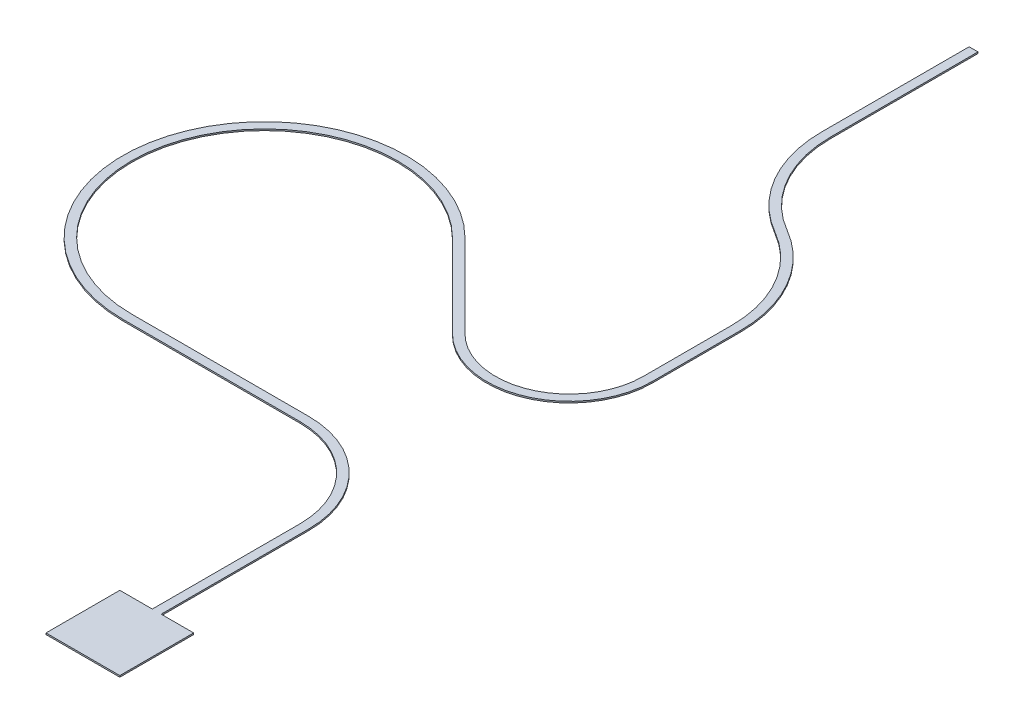
ISO-10303-21;
HEADER;
FILE_DESCRIPTION(('STEP AP214'),'2;1');
FILE_NAME('part.step','',(''),(''),'','','');
FILE_SCHEMA(('AUTOMOTIVE_DESIGN { 1 0 10303 214 1 1 1 1 }'));
ENDSEC;
DATA;
#1=APPLICATION_CONTEXT('core data for automotive mechanical design processes');
#2=APPLICATION_PROTOCOL_DEFINITION('international standard','automotive_design',2000,#1);
#3=PRODUCT_CONTEXT('',#1,'mechanical');
#4=PRODUCT('Part','Part','',(#3));
#5=PRODUCT_RELATED_PRODUCT_CATEGORY('part','',(#4));
#6=PRODUCT_DEFINITION_FORMATION('','',#4);
#7=PRODUCT_DEFINITION_CONTEXT('part definition',#1,'design');
#8=PRODUCT_DEFINITION('design','',#6,#7);
#9=PRODUCT_DEFINITION_SHAPE('','',#8);
#10=(LENGTH_UNIT() NAMED_UNIT(*) SI_UNIT(.MILLI.,.METRE.));
#11=(NAMED_UNIT(*) PLANE_ANGLE_UNIT() SI_UNIT($,.RADIAN.));
#12=(NAMED_UNIT(*) SI_UNIT($,.STERADIAN.) SOLID_ANGLE_UNIT());
#13=UNCERTAINTY_MEASURE_WITH_UNIT(LENGTH_MEASURE(1.E-05),#10,'distance_accuracy_value','');
#14=(GEOMETRIC_REPRESENTATION_CONTEXT(3) GLOBAL_UNCERTAINTY_ASSIGNED_CONTEXT((#13)) GLOBAL_UNIT_ASSIGNED_CONTEXT((#10,
#11,#12)) REPRESENTATION_CONTEXT('',''));
#15=CARTESIAN_POINT('',(0.,0.,0.));
#16=DIRECTION('',(0.,0.,1.));
#17=DIRECTION('',(1.,0.,0.));
#18=AXIS2_PLACEMENT_3D('',#15,#16,#17);
#19=CARTESIAN_POINT('',(125.,5.,-125.));
#20=DIRECTION('',(-1.,0.,0.));
#21=DIRECTION('',(0.,0.,1.));
#22=AXIS2_PLACEMENT_3D('',#19,#20,#21);
#23=PLANE('',#22);
#24=DIRECTION('',(0.,0.,-1.));
#25=VECTOR('',#24,1.);
#26=CARTESIAN_POINT('',(125.,0.,-125.));
#27=LINE('',#26,#25);
#28=CARTESIAN_POINT('',(125.,0.,125.));
#29=VERTEX_POINT('',#28);
#30=CARTESIAN_POINT('',(125.,0.,-125.));
#31=VERTEX_POINT('',#30);
#32=EDGE_CURVE('E248',#29,#31,#27,.T.);
#33=ORIENTED_EDGE('',*,*,#32,.T.);
#34=DIRECTION('',(0.,-1.,0.));
#35=VECTOR('',#34,1.);
#36=CARTESIAN_POINT('',(125.,5.,-125.));
#37=LINE('',#36,#35);
#38=CARTESIAN_POINT('',(125.,5.,-125.));
#39=VERTEX_POINT('',#38);
#40=EDGE_CURVE('E11',#39,#31,#37,.T.);
#41=ORIENTED_EDGE('',*,*,#40,.F.);
#42=DIRECTION('',(0.,0.,-1.));
#43=VECTOR('',#42,1.);
#44=CARTESIAN_POINT('',(125.,5.,-125.));
#45=LINE('',#44,#43);
#46=CARTESIAN_POINT('',(125.,5.,125.));
#47=VERTEX_POINT('',#46);
#48=EDGE_CURVE('E324',#47,#39,#45,.T.);
#49=ORIENTED_EDGE('',*,*,#48,.F.);
#50=DIRECTION('',(0.,-1.,0.));
#51=VECTOR('',#50,1.);
#52=CARTESIAN_POINT('',(125.,5.,125.));
#53=LINE('',#52,#51);
#54=EDGE_CURVE('E244',#47,#29,#53,.T.);
#55=ORIENTED_EDGE('',*,*,#54,.T.);
#56=EDGE_LOOP('',(#33,#41,#49,#55));
#57=FACE_BOUND('',#56,.T.);
#58=ADVANCED_FACE('F39',(#57),#23,.F.);
#59=CARTESIAN_POINT('',(15.,5.,-125.));
#60=DIRECTION('',(0.,0.,1.));
#61=DIRECTION('',(1.,0.,0.));
#62=AXIS2_PLACEMENT_3D('',#59,#60,#61);
#63=PLANE('',#62);
#64=DIRECTION('',(-1.,0.,0.));
#65=VECTOR('',#64,1.);
#66=CARTESIAN_POINT('',(15.,0.,-125.));
#67=LINE('',#66,#65);
#68=CARTESIAN_POINT('',(15.,0.,-125.));
#69=VERTEX_POINT('',#68);
#70=EDGE_CURVE('E252',#31,#69,#67,.T.);
#71=ORIENTED_EDGE('',*,*,#70,.T.);
#72=DIRECTION('',(0.,-1.,0.));
#73=VECTOR('',#72,1.);
#74=CARTESIAN_POINT('',(15.,5.,-125.));
#75=LINE('',#74,#73);
#76=CARTESIAN_POINT('',(15.,5.,-125.));
#77=VERTEX_POINT('',#76);
#78=EDGE_CURVE('E48',#77,#69,#75,.T.);
#79=ORIENTED_EDGE('',*,*,#78,.F.);
#80=DIRECTION('',(-1.,0.,0.));
#81=VECTOR('',#80,1.);
#82=CARTESIAN_POINT('',(15.,5.,-125.));
#83=LINE('',#82,#81);
#84=EDGE_CURVE('E153',#39,#77,#83,.T.);
#85=ORIENTED_EDGE('',*,*,#84,.F.);
#86=ORIENTED_EDGE('',*,*,#40,.T.);
#87=EDGE_LOOP('',(#71,#79,#85,#86));
#88=FACE_BOUND('',#87,.T.);
#89=ADVANCED_FACE('F516',(#88),#63,.F.);
#90=CARTESIAN_POINT('',(15.,5.,-125.));
#91=DIRECTION('',(-1.,0.,0.));
#92=DIRECTION('',(0.,0.,1.));
#93=AXIS2_PLACEMENT_3D('',#90,#91,#92);
#94=PLANE('',#93);
#95=DIRECTION('',(0.,0.,-1.));
#96=VECTOR('',#95,1.);
#97=CARTESIAN_POINT('',(15.,0.,-125.));
#98=LINE('',#97,#96);
#99=CARTESIAN_POINT('',(14.9999999999999,0.,-625.));
#100=VERTEX_POINT('',#99);
#101=EDGE_CURVE('E255',#69,#100,#98,.T.);
#102=ORIENTED_EDGE('',*,*,#101,.T.);
#103=DIRECTION('',(0.,-1.,0.));
#104=VECTOR('',#103,1.);
#105=CARTESIAN_POINT('',(14.9999999999999,5.,-625.));
#106=LINE('',#105,#104);
#107=CARTESIAN_POINT('',(14.9999999999999,5.,-625.));
#108=VERTEX_POINT('',#107);
#109=EDGE_CURVE('E407',#108,#100,#106,.T.);
#110=ORIENTED_EDGE('',*,*,#109,.F.);
#111=DIRECTION('',(0.,0.,-1.));
#112=VECTOR('',#111,1.);
#113=CARTESIAN_POINT('',(15.,5.,-125.));
#114=LINE('',#113,#112);
#115=EDGE_CURVE('E417',#77,#108,#114,.T.);
#116=ORIENTED_EDGE('',*,*,#115,.F.);
#117=ORIENTED_EDGE('',*,*,#78,.T.);
#118=EDGE_LOOP('',(#102,#110,#116,#117));
#119=FACE_BOUND('',#118,.T.);
#120=ADVANCED_FACE('F415',(#119),#94,.F.);
#121=CARTESIAN_POINT('',(-315.,5.,-625.));
#122=DIRECTION('',(0.,-1.,0.));
#123=DIRECTION('',(0.,0.,-1.));
#124=AXIS2_PLACEMENT_3D('',#121,#122,#123);
#125=CYLINDRICAL_SURFACE('',#124,330.);
#126=CARTESIAN_POINT('',(-315.,0.,-625.));
#127=DIRECTION('',(0.,1.,0.));
#128=DIRECTION('',(0.,0.,1.));
#129=AXIS2_PLACEMENT_3D('',#126,#127,#128);
#130=CIRCLE('',#129,330.);
#131=CARTESIAN_POINT('',(-315.,0.,-955.));
#132=VERTEX_POINT('',#131);
#133=EDGE_CURVE('E258',#100,#132,#130,.T.);
#134=ORIENTED_EDGE('',*,*,#133,.T.);
#135=DIRECTION('',(0.,-1.,0.));
#136=VECTOR('',#135,1.);
#137=CARTESIAN_POINT('',(-315.,5.,-955.));
#138=LINE('',#137,#136);
#139=CARTESIAN_POINT('',(-315.,5.,-955.));
#140=VERTEX_POINT('',#139);
#141=EDGE_CURVE('E403',#140,#132,#138,.T.);
#142=ORIENTED_EDGE('',*,*,#141,.F.);
#143=CARTESIAN_POINT('',(-315.,5.,-625.));
#144=DIRECTION('',(0.,1.,0.));
#145=DIRECTION('',(0.,0.,1.));
#146=AXIS2_PLACEMENT_3D('',#143,#144,#145);
#147=CIRCLE('',#146,330.);
#148=EDGE_CURVE('E436',#108,#140,#147,.T.);
#149=ORIENTED_EDGE('',*,*,#148,.F.);
#150=ORIENTED_EDGE('',*,*,#109,.T.);
#151=EDGE_LOOP('',(#134,#142,#149,#150));
#152=FACE_BOUND('',#151,.T.);
#153=ADVANCED_FACE('F426',(#152),#125,.T.);
#154=CARTESIAN_POINT('',(-315.,5.,-955.));
#155=DIRECTION('',(0.,0.,1.));
#156=DIRECTION('',(1.,0.,0.));
#157=AXIS2_PLACEMENT_3D('',#154,#155,#156);
#158=PLANE('',#157);
#159=DIRECTION('',(-1.,0.,0.));
#160=VECTOR('',#159,1.);
#161=CARTESIAN_POINT('',(-315.,0.,-955.));
#162=LINE('',#161,#160);
#163=CARTESIAN_POINT('',(-915.,0.,-955.));
#164=VERTEX_POINT('',#163);
#165=EDGE_CURVE('E261',#132,#164,#162,.T.);
#166=ORIENTED_EDGE('',*,*,#165,.T.);
#167=DIRECTION('',(0.,-1.,0.));
#168=VECTOR('',#167,1.);
#169=CARTESIAN_POINT('',(-915.,5.,-955.));
#170=LINE('',#169,#168);
#171=CARTESIAN_POINT('',(-915.,5.,-955.));
#172=VERTEX_POINT('',#171);
#173=EDGE_CURVE('E399',#172,#164,#170,.T.);
#174=ORIENTED_EDGE('',*,*,#173,.F.);
#175=DIRECTION('',(-1.,0.,0.));
#176=VECTOR('',#175,1.);
#177=CARTESIAN_POINT('',(-315.,5.,-955.));
#178=LINE('',#177,#176);
#179=EDGE_CURVE('E432',#140,#172,#178,.T.);
#180=ORIENTED_EDGE('',*,*,#179,.F.);
#181=ORIENTED_EDGE('',*,*,#141,.T.);
#182=EDGE_LOOP('',(#166,#174,#180,#181));
#183=FACE_BOUND('',#182,.T.);
#184=ADVANCED_FACE('F430',(#183),#158,.F.);
#185=CARTESIAN_POINT('',(-915.,5.,-1405.));
#186=DIRECTION('',(0.,-1.,0.));
#187=DIRECTION('',(0.,0.,-1.));
#188=AXIS2_PLACEMENT_3D('',#185,#186,#187);
#189=CYLINDRICAL_SURFACE('',#188,450.);
#190=CARTESIAN_POINT('',(-915.,0.,-1405.));
#191=DIRECTION('',(0.,-1.,0.));
#192=DIRECTION('',(0.,0.,-1.));
#193=AXIS2_PLACEMENT_3D('',#190,#191,#192);
#194=CIRCLE('',#193,450.);
#195=CARTESIAN_POINT('',(-596.801948466055,0.,-1723.19805153395));
#196=VERTEX_POINT('',#195);
#197=EDGE_CURVE('E264',#164,#196,#194,.T.);
#198=ORIENTED_EDGE('',*,*,#197,.T.);
#199=DIRECTION('',(0.,-1.,0.));
#200=VECTOR('',#199,1.);
#201=CARTESIAN_POINT('',(-596.801948466055,5.,-1723.19805153395));
#202=LINE('',#201,#200);
#203=CARTESIAN_POINT('',(-596.801948466055,5.,-1723.19805153395));
#204=VERTEX_POINT('',#203);
#205=EDGE_CURVE('E395',#204,#196,#202,.T.);
#206=ORIENTED_EDGE('',*,*,#205,.F.);
#207=CARTESIAN_POINT('',(-915.,5.,-1405.));
#208=DIRECTION('',(0.,-1.,0.));
#209=DIRECTION('',(0.,0.,-1.));
#210=AXIS2_PLACEMENT_3D('',#207,#208,#209);
#211=CIRCLE('',#210,450.);
#212=EDGE_CURVE('E435',#172,#204,#211,.T.);
#213=ORIENTED_EDGE('',*,*,#212,.F.);
#214=ORIENTED_EDGE('',*,*,#173,.T.);
#215=EDGE_LOOP('',(#198,#206,#213,#214));
#216=FACE_BOUND('',#215,.T.);
#217=ADVANCED_FACE('F529',(#216),#189,.F.);
#218=CARTESIAN_POINT('',(-596.801948466055,5.,-1723.19805153395));
#219=DIRECTION('',(0.707106781186542,0.,-0.707106781186553));
#220=DIRECTION('',(-0.707106781186553,0.,-0.707106781186542));
#221=AXIS2_PLACEMENT_3D('',#218,#219,#220);
#222=PLANE('',#221);
#223=DIRECTION('',(0.707106781186553,0.,0.707106781186543));
#224=VECTOR('',#223,1.);
#225=CARTESIAN_POINT('',(-596.801948466055,0.,-1723.19805153395));
#226=LINE('',#225,#224);
#227=CARTESIAN_POINT('',(-313.959235991436,0.,-1440.35533905933));
#228=VERTEX_POINT('',#227);
#229=EDGE_CURVE('E267',#196,#228,#226,.T.);
#230=ORIENTED_EDGE('',*,*,#229,.T.);
#231=DIRECTION('',(0.,-1.,0.));
#232=VECTOR('',#231,1.);
#233=CARTESIAN_POINT('',(-313.959235991436,5.,-1440.35533905933));
#234=LINE('',#233,#232);
#235=CARTESIAN_POINT('',(-313.959235991436,5.,-1440.35533905933));
#236=VERTEX_POINT('',#235);
#237=EDGE_CURVE('E391',#236,#228,#234,.T.);
#238=ORIENTED_EDGE('',*,*,#237,.F.);
#239=DIRECTION('',(0.707106781186553,0.,0.707106781186543));
#240=VECTOR('',#239,1.);
#241=CARTESIAN_POINT('',(-596.801948466055,5.,-1723.19805153395));
#242=LINE('',#241,#240);
#243=EDGE_CURVE('E440',#204,#236,#242,.T.);
#244=ORIENTED_EDGE('',*,*,#243,.F.);
#245=ORIENTED_EDGE('',*,*,#205,.T.);
#246=EDGE_LOOP('',(#230,#238,#244,#245));
#247=FACE_BOUND('',#246,.T.);
#248=ADVANCED_FACE('F532',(#247),#222,.F.);
#249=CARTESIAN_POINT('',(-115.969337259203,5.,-1638.34523779157));
#250=DIRECTION('',(0.,-1.,0.));
#251=DIRECTION('',(0.,0.,-1.));
#252=AXIS2_PLACEMENT_3D('',#249,#250,#251);
#253=CYLINDRICAL_SURFACE('',#252,280.);
#254=CARTESIAN_POINT('',(-115.969337259203,0.,-1638.34523779157));
#255=DIRECTION('',(0.,1.,0.));
#256=DIRECTION('',(0.,0.,1.));
#257=AXIS2_PLACEMENT_3D('',#254,#255,#256);
#258=CIRCLE('',#257,280.);
#259=CARTESIAN_POINT('',(164.030662740797,0.,-1638.34523779157));
#260=VERTEX_POINT('',#259);
#261=EDGE_CURVE('E270',#228,#260,#258,.T.);
#262=ORIENTED_EDGE('',*,*,#261,.T.);
#263=DIRECTION('',(0.,-1.,0.));
#264=VECTOR('',#263,1.);
#265=CARTESIAN_POINT('',(164.030662740797,5.,-1638.34523779157));
#266=LINE('',#265,#264);
#267=CARTESIAN_POINT('',(164.030662740797,5.,-1638.34523779157));
#268=VERTEX_POINT('',#267);
#269=EDGE_CURVE('E387',#268,#260,#266,.T.);
#270=ORIENTED_EDGE('',*,*,#269,.F.);
#271=CARTESIAN_POINT('',(-115.969337259203,5.,-1638.34523779157));
#272=DIRECTION('',(0.,1.,0.));
#273=DIRECTION('',(0.,0.,1.));
#274=AXIS2_PLACEMENT_3D('',#271,#272,#273);
#275=CIRCLE('',#274,280.);
#276=EDGE_CURVE('E447',#236,#268,#275,.T.);
#277=ORIENTED_EDGE('',*,*,#276,.F.);
#278=ORIENTED_EDGE('',*,*,#237,.T.);
#279=EDGE_LOOP('',(#262,#270,#277,#278));
#280=FACE_BOUND('',#279,.T.);
#281=ADVANCED_FACE('F536',(#280),#253,.T.);
#282=CARTESIAN_POINT('',(164.030662740797,5.,-1638.34523779157));
#283=DIRECTION('',(-1.,0.,0.));
#284=DIRECTION('',(0.,0.,1.));
#285=AXIS2_PLACEMENT_3D('',#282,#283,#284);
#286=PLANE('',#285);
#287=DIRECTION('',(0.,0.,-1.));
#288=VECTOR('',#287,1.);
#289=CARTESIAN_POINT('',(164.030662740797,0.,-1638.34523779157));
#290=LINE('',#289,#288);
#291=CARTESIAN_POINT('',(164.030662740797,0.,-1938.34523779157));
#292=VERTEX_POINT('',#291);
#293=EDGE_CURVE('E273',#260,#292,#290,.T.);
#294=ORIENTED_EDGE('',*,*,#293,.T.);
#295=DIRECTION('',(0.,-1.,0.));
#296=VECTOR('',#295,1.);
#297=CARTESIAN_POINT('',(164.030662740797,5.,-1938.34523779157));
#298=LINE('',#297,#296);
#299=CARTESIAN_POINT('',(164.030662740797,5.,-1938.34523779157));
#300=VERTEX_POINT('',#299);
#301=EDGE_CURVE('E383',#300,#292,#298,.T.);
#302=ORIENTED_EDGE('',*,*,#301,.F.);
#303=DIRECTION('',(0.,0.,-1.));
#304=VECTOR('',#303,1.);
#305=CARTESIAN_POINT('',(164.030662740797,5.,-1638.34523779157));
#306=LINE('',#305,#304);
#307=EDGE_CURVE('E450',#268,#300,#306,.T.);
#308=ORIENTED_EDGE('',*,*,#307,.F.);
#309=ORIENTED_EDGE('',*,*,#269,.T.);
#310=EDGE_LOOP('',(#294,#302,#308,#309));
#311=FACE_BOUND('',#310,.T.);
#312=ADVANCED_FACE('F540',(#311),#286,.F.);
#313=CARTESIAN_POINT('',(-265.969337259203,5.,-1938.34523779157));
#314=DIRECTION('',(0.,-1.,0.));
#315=DIRECTION('',(0.,0.,-1.));
#316=AXIS2_PLACEMENT_3D('',#313,#314,#315);
#317=CYLINDRICAL_SURFACE('',#316,430.);
#318=CARTESIAN_POINT('',(-265.969337259203,0.,-1938.34523779157));
#319=DIRECTION('',(0.,1.,0.));
#320=DIRECTION('',(0.,0.,1.));
#321=AXIS2_PLACEMENT_3D('',#318,#319,#320);
#322=CIRCLE('',#321,430.);
#323=CARTESIAN_POINT('',(-50.9693372592044,0.,-2310.73616141887));
#324=VERTEX_POINT('',#323);
#325=EDGE_CURVE('E276',#292,#324,#322,.T.);
#326=ORIENTED_EDGE('',*,*,#325,.T.);
#327=DIRECTION('',(0.,-1.,0.));
#328=VECTOR('',#327,1.);
#329=CARTESIAN_POINT('',(-50.9693372592044,5.,-2310.73616141887));
#330=LINE('',#329,#328);
#331=CARTESIAN_POINT('',(-50.9693372592044,5.,-2310.73616141887));
#332=VERTEX_POINT('',#331);
#333=EDGE_CURVE('E379',#332,#324,#330,.T.);
#334=ORIENTED_EDGE('',*,*,#333,.F.);
#335=CARTESIAN_POINT('',(-265.969337259203,5.,-1938.34523779157));
#336=DIRECTION('',(0.,1.,0.));
#337=DIRECTION('',(0.,0.,1.));
#338=AXIS2_PLACEMENT_3D('',#335,#336,#337);
#339=CIRCLE('',#338,430.);
#340=EDGE_CURVE('E453',#300,#332,#339,.T.);
#341=ORIENTED_EDGE('',*,*,#340,.F.);
#342=ORIENTED_EDGE('',*,*,#301,.T.);
#343=EDGE_LOOP('',(#326,#334,#341,#342));
#344=FACE_BOUND('',#343,.T.);
#345=ADVANCED_FACE('F544',(#344),#317,.T.);
#346=CARTESIAN_POINT('',(149.030662740796,5.,-2657.14632293265));
#347=DIRECTION('',(0.,-1.,0.));
#348=DIRECTION('',(0.,0.,-1.));
#349=AXIS2_PLACEMENT_3D('',#346,#347,#348);
#350=CYLINDRICAL_SURFACE('',#349,400.000000000001);
#351=CARTESIAN_POINT('',(149.030662740796,0.,-2657.14632293265));
#352=DIRECTION('',(0.,-1.,0.));
#353=DIRECTION('',(0.,0.,-1.));
#354=AXIS2_PLACEMENT_3D('',#351,#352,#353);
#355=CIRCLE('',#354,400.000000000001);
#356=CARTESIAN_POINT('',(-250.969337259206,0.,-2657.14632293265));
#357=VERTEX_POINT('',#356);
#358=EDGE_CURVE('E279',#324,#357,#355,.T.);
#359=ORIENTED_EDGE('',*,*,#358,.T.);
#360=DIRECTION('',(0.,-1.,0.));
#361=VECTOR('',#360,1.);
#362=CARTESIAN_POINT('',(-250.969337259206,5.,-2657.14632293265));
#363=LINE('',#362,#361);
#364=CARTESIAN_POINT('',(-250.969337259206,5.,-2657.14632293265));
#365=VERTEX_POINT('',#364);
#366=EDGE_CURVE('E375',#365,#357,#363,.T.);
#367=ORIENTED_EDGE('',*,*,#366,.F.);
#368=CARTESIAN_POINT('',(149.030662740796,5.,-2657.14632293265));
#369=DIRECTION('',(0.,-1.,0.));
#370=DIRECTION('',(0.,0.,-1.));
#371=AXIS2_PLACEMENT_3D('',#368,#369,#370);
#372=CIRCLE('',#371,400.000000000001);
#373=EDGE_CURVE('E456',#332,#365,#372,.T.);
#374=ORIENTED_EDGE('',*,*,#373,.F.);
#375=ORIENTED_EDGE('',*,*,#333,.T.);
#376=EDGE_LOOP('',(#359,#367,#374,#375));
#377=FACE_BOUND('',#376,.T.);
#378=ADVANCED_FACE('F548',(#377),#350,.F.);
#379=CARTESIAN_POINT('',(-250.969337259206,5.,-2657.14632293265));
#380=DIRECTION('',(-1.,0.,0.));
#381=DIRECTION('',(0.,0.,1.));
#382=AXIS2_PLACEMENT_3D('',#379,#380,#381);
#383=PLANE('',#382);
#384=DIRECTION('',(0.,0.,-1.));
#385=VECTOR('',#384,1.);
#386=CARTESIAN_POINT('',(-250.969337259206,0.,-2657.14632293265));
#387=LINE('',#386,#385);
#388=CARTESIAN_POINT('',(-250.969337259206,0.,-3157.14632293265));
#389=VERTEX_POINT('',#388);
#390=EDGE_CURVE('E282',#357,#389,#387,.T.);
#391=ORIENTED_EDGE('',*,*,#390,.T.);
#392=DIRECTION('',(0.,-1.,0.));
#393=VECTOR('',#392,1.);
#394=CARTESIAN_POINT('',(-250.969337259206,5.,-3157.14632293265));
#395=LINE('',#394,#393);
#396=CARTESIAN_POINT('',(-250.969337259206,5.,-3157.14632293265));
#397=VERTEX_POINT('',#396);
#398=EDGE_CURVE('E371',#397,#389,#395,.T.);
#399=ORIENTED_EDGE('',*,*,#398,.F.);
#400=DIRECTION('',(0.,0.,-1.));
#401=VECTOR('',#400,1.);
#402=CARTESIAN_POINT('',(-250.969337259206,5.,-2657.14632293265));
#403=LINE('',#402,#401);
#404=EDGE_CURVE('E459',#365,#397,#403,.T.);
#405=ORIENTED_EDGE('',*,*,#404,.F.);
#406=ORIENTED_EDGE('',*,*,#366,.T.);
#407=EDGE_LOOP('',(#391,#399,#405,#406));
#408=FACE_BOUND('',#407,.T.);
#409=ADVANCED_FACE('F552',(#408),#383,.F.);
#410=CARTESIAN_POINT('',(-280.969337259205,5.,-3157.14632293265));
#411=DIRECTION('',(0.,0.,1.));
#412=DIRECTION('',(1.,0.,0.));
#413=AXIS2_PLACEMENT_3D('',#410,#411,#412);
#414=PLANE('',#413);
#415=DIRECTION('',(-1.,0.,0.));
#416=VECTOR('',#415,1.);
#417=CARTESIAN_POINT('',(-280.969337259205,0.,-3157.14632293265));
#418=LINE('',#417,#416);
#419=CARTESIAN_POINT('',(-280.969337259205,0.,-3157.14632293265));
#420=VERTEX_POINT('',#419);
#421=EDGE_CURVE('E285',#389,#420,#418,.T.);
#422=ORIENTED_EDGE('',*,*,#421,.T.);
#423=DIRECTION('',(0.,-1.,0.));
#424=VECTOR('',#423,1.);
#425=CARTESIAN_POINT('',(-280.969337259205,5.,-3157.14632293265));
#426=LINE('',#425,#424);
#427=CARTESIAN_POINT('',(-280.969337259205,5.,-3157.14632293265));
#428=VERTEX_POINT('',#427);
#429=EDGE_CURVE('E367',#428,#420,#426,.T.);
#430=ORIENTED_EDGE('',*,*,#429,.F.);
#431=DIRECTION('',(-1.,0.,0.));
#432=VECTOR('',#431,1.);
#433=CARTESIAN_POINT('',(-280.969337259205,5.,-3157.14632293265));
#434=LINE('',#433,#432);
#435=EDGE_CURVE('E462',#397,#428,#434,.T.);
#436=ORIENTED_EDGE('',*,*,#435,.F.);
#437=ORIENTED_EDGE('',*,*,#398,.T.);
#438=EDGE_LOOP('',(#422,#430,#436,#437));
#439=FACE_BOUND('',#438,.T.);
#440=ADVANCED_FACE('F556',(#439),#414,.F.);
#441=CARTESIAN_POINT('',(-280.969337259205,5.,-2657.14632293265));
#442=DIRECTION('',(1.,0.,0.));
#443=DIRECTION('',(0.,0.,-1.));
#444=AXIS2_PLACEMENT_3D('',#441,#442,#443);
#445=PLANE('',#444);
#446=DIRECTION('',(0.,0.,1.));
#447=VECTOR('',#446,1.);
#448=CARTESIAN_POINT('',(-280.969337259205,0.,-2657.14632293265));
#449=LINE('',#448,#447);
#450=CARTESIAN_POINT('',(-280.969337259204,0.,-2657.14632293265));
#451=VERTEX_POINT('',#450);
#452=EDGE_CURVE('E288',#420,#451,#449,.T.);
#453=ORIENTED_EDGE('',*,*,#452,.T.);
#454=DIRECTION('',(0.,-1.,0.));
#455=VECTOR('',#454,1.);
#456=CARTESIAN_POINT('',(-280.969337259204,5.,-2657.14632293265));
#457=LINE('',#456,#455);
#458=CARTESIAN_POINT('',(-280.969337259204,5.,-2657.14632293265));
#459=VERTEX_POINT('',#458);
#460=EDGE_CURVE('E363',#459,#451,#457,.T.);
#461=ORIENTED_EDGE('',*,*,#460,.F.);
#462=DIRECTION('',(0.,0.,1.));
#463=VECTOR('',#462,1.);
#464=CARTESIAN_POINT('',(-280.969337259205,5.,-2657.14632293265));
#465=LINE('',#464,#463);
#466=EDGE_CURVE('E465',#428,#459,#465,.T.);
#467=ORIENTED_EDGE('',*,*,#466,.F.);
#468=ORIENTED_EDGE('',*,*,#429,.T.);
#469=EDGE_LOOP('',(#453,#461,#467,#468));
#470=FACE_BOUND('',#469,.T.);
#471=ADVANCED_FACE('F560',(#470),#445,.F.);
#472=CARTESIAN_POINT('',(149.030662740796,5.,-2657.14632293265));
#473=DIRECTION('',(0.,-1.,0.));
#474=DIRECTION('',(0.,0.,-1.));
#475=AXIS2_PLACEMENT_3D('',#472,#473,#474);
#476=CYLINDRICAL_SURFACE('',#475,430.);
#477=CARTESIAN_POINT('',(149.030662740796,0.,-2657.14632293265));
#478=DIRECTION('',(0.,1.,0.));
#479=DIRECTION('',(0.,0.,-1.));
#480=AXIS2_PLACEMENT_3D('',#477,#478,#479);
#481=CIRCLE('',#480,430.);
#482=CARTESIAN_POINT('',(-65.9693372592044,0.,-2284.75539930534));
#483=VERTEX_POINT('',#482);
#484=EDGE_CURVE('E291',#451,#483,#481,.T.);
#485=ORIENTED_EDGE('',*,*,#484,.T.);
#486=DIRECTION('',(0.,-1.,0.));
#487=VECTOR('',#486,1.);
#488=CARTESIAN_POINT('',(-65.9693372592044,5.,-2284.75539930534));
#489=LINE('',#488,#487);
#490=CARTESIAN_POINT('',(-65.9693372592044,5.,-2284.75539930534));
#491=VERTEX_POINT('',#490);
#492=EDGE_CURVE('E359',#491,#483,#489,.T.);
#493=ORIENTED_EDGE('',*,*,#492,.F.);
#494=CARTESIAN_POINT('',(149.030662740796,5.,-2657.14632293265));
#495=DIRECTION('',(0.,1.,0.));
#496=DIRECTION('',(0.,0.,-1.));
#497=AXIS2_PLACEMENT_3D('',#494,#495,#496);
#498=CIRCLE('',#497,430.);
#499=EDGE_CURVE('E468',#459,#491,#498,.T.);
#500=ORIENTED_EDGE('',*,*,#499,.F.);
#501=ORIENTED_EDGE('',*,*,#460,.T.);
#502=EDGE_LOOP('',(#485,#493,#500,#501));
#503=FACE_BOUND('',#502,.T.);
#504=ADVANCED_FACE('F564',(#503),#476,.T.);
#505=CARTESIAN_POINT('',(-265.969337259203,5.,-1938.34523779157));
#506=DIRECTION('',(0.,-1.,0.));
#507=DIRECTION('',(0.,0.,-1.));
#508=AXIS2_PLACEMENT_3D('',#505,#506,#507);
#509=CYLINDRICAL_SURFACE('',#508,400.);
#510=CARTESIAN_POINT('',(-265.969337259203,0.,-1938.34523779157));
#511=DIRECTION('',(0.,-1.,0.));
#512=DIRECTION('',(0.,0.,1.));
#513=AXIS2_PLACEMENT_3D('',#510,#511,#512);
#514=CIRCLE('',#513,400.);
#515=CARTESIAN_POINT('',(134.030662740797,0.,-1938.34523779157));
#516=VERTEX_POINT('',#515);
#517=EDGE_CURVE('E294',#483,#516,#514,.T.);
#518=ORIENTED_EDGE('',*,*,#517,.T.);
#519=DIRECTION('',(0.,-1.,0.));
#520=VECTOR('',#519,1.);
#521=CARTESIAN_POINT('',(134.030662740797,5.,-1938.34523779157));
#522=LINE('',#521,#520);
#523=CARTESIAN_POINT('',(134.030662740797,5.,-1938.34523779157));
#524=VERTEX_POINT('',#523);
#525=EDGE_CURVE('E355',#524,#516,#522,.T.);
#526=ORIENTED_EDGE('',*,*,#525,.F.);
#527=CARTESIAN_POINT('',(-265.969337259203,5.,-1938.34523779157));
#528=DIRECTION('',(0.,-1.,0.));
#529=DIRECTION('',(0.,0.,1.));
#530=AXIS2_PLACEMENT_3D('',#527,#528,#529);
#531=CIRCLE('',#530,400.);
#532=EDGE_CURVE('E471',#491,#524,#531,.T.);
#533=ORIENTED_EDGE('',*,*,#532,.F.);
#534=ORIENTED_EDGE('',*,*,#492,.T.);
#535=EDGE_LOOP('',(#518,#526,#533,#534));
#536=FACE_BOUND('',#535,.T.);
#537=ADVANCED_FACE('F568',(#536),#509,.F.);
#538=CARTESIAN_POINT('',(134.030662740797,5.,-1638.34523779157));
#539=DIRECTION('',(1.,0.,0.));
#540=DIRECTION('',(0.,0.,-1.));
#541=AXIS2_PLACEMENT_3D('',#538,#539,#540);
#542=PLANE('',#541);
#543=DIRECTION('',(0.,0.,1.));
#544=VECTOR('',#543,1.);
#545=CARTESIAN_POINT('',(134.030662740797,0.,-1638.34523779157));
#546=LINE('',#545,#544);
#547=CARTESIAN_POINT('',(134.030662740797,0.,-1638.34523779157));
#548=VERTEX_POINT('',#547);
#549=EDGE_CURVE('E297',#516,#548,#546,.T.);
#550=ORIENTED_EDGE('',*,*,#549,.T.);
#551=DIRECTION('',(0.,-1.,0.));
#552=VECTOR('',#551,1.);
#553=CARTESIAN_POINT('',(134.030662740797,5.,-1638.34523779157));
#554=LINE('',#553,#552);
#555=CARTESIAN_POINT('',(134.030662740797,5.,-1638.34523779157));
#556=VERTEX_POINT('',#555);
#557=EDGE_CURVE('E351',#556,#548,#554,.T.);
#558=ORIENTED_EDGE('',*,*,#557,.F.);
#559=DIRECTION('',(0.,0.,1.));
#560=VECTOR('',#559,1.);
#561=CARTESIAN_POINT('',(134.030662740797,5.,-1638.34523779157));
#562=LINE('',#561,#560);
#563=EDGE_CURVE('E474',#524,#556,#562,.T.);
#564=ORIENTED_EDGE('',*,*,#563,.F.);
#565=ORIENTED_EDGE('',*,*,#525,.T.);
#566=EDGE_LOOP('',(#550,#558,#564,#565));
#567=FACE_BOUND('',#566,.T.);
#568=ADVANCED_FACE('F572',(#567),#542,.F.);
#569=CARTESIAN_POINT('',(-115.969337259203,5.,-1638.34523779157));
#570=DIRECTION('',(0.,-1.,0.));
#571=DIRECTION('',(0.,0.,-1.));
#572=AXIS2_PLACEMENT_3D('',#569,#570,#571);
#573=CYLINDRICAL_SURFACE('',#572,250.);
#574=CARTESIAN_POINT('',(-115.969337259203,0.,-1638.34523779157));
#575=DIRECTION('',(0.,-1.,0.));
#576=DIRECTION('',(0.,0.,1.));
#577=AXIS2_PLACEMENT_3D('',#574,#575,#576);
#578=CIRCLE('',#577,250.);
#579=CARTESIAN_POINT('',(-292.746032555839,0.,-1461.56854249493));
#580=VERTEX_POINT('',#579);
#581=EDGE_CURVE('E300',#548,#580,#578,.T.);
#582=ORIENTED_EDGE('',*,*,#581,.T.);
#583=DIRECTION('',(0.,-1.,0.));
#584=VECTOR('',#583,1.);
#585=CARTESIAN_POINT('',(-292.746032555839,5.,-1461.56854249493));
#586=LINE('',#585,#584);
#587=CARTESIAN_POINT('',(-292.746032555839,5.,-1461.56854249493));
#588=VERTEX_POINT('',#587);
#589=EDGE_CURVE('E347',#588,#580,#586,.T.);
#590=ORIENTED_EDGE('',*,*,#589,.F.);
#591=CARTESIAN_POINT('',(-115.969337259203,5.,-1638.34523779157));
#592=DIRECTION('',(0.,-1.,0.));
#593=DIRECTION('',(0.,0.,1.));
#594=AXIS2_PLACEMENT_3D('',#591,#592,#593);
#595=CIRCLE('',#594,250.);
#596=EDGE_CURVE('E477',#556,#588,#595,.T.);
#597=ORIENTED_EDGE('',*,*,#596,.F.);
#598=ORIENTED_EDGE('',*,*,#557,.T.);
#599=EDGE_LOOP('',(#582,#590,#597,#598));
#600=FACE_BOUND('',#599,.T.);
#601=ADVANCED_FACE('F576',(#600),#573,.F.);
#602=CARTESIAN_POINT('',(-575.588745030459,5.,-1744.41125496954));
#603=DIRECTION('',(-0.707106781186542,0.,0.707106781186553));
#604=DIRECTION('',(0.707106781186553,0.,0.707106781186542));
#605=AXIS2_PLACEMENT_3D('',#602,#603,#604);
#606=PLANE('',#605);
#607=DIRECTION('',(-0.707106781186553,0.,-0.707106781186542));
#608=VECTOR('',#607,1.);
#609=CARTESIAN_POINT('',(-575.588745030459,0.,-1744.41125496954));
#610=LINE('',#609,#608);
#611=CARTESIAN_POINT('',(-575.588745030459,0.,-1744.41125496954));
#612=VERTEX_POINT('',#611);
#613=EDGE_CURVE('E303',#580,#612,#610,.T.);
#614=ORIENTED_EDGE('',*,*,#613,.T.);
#615=DIRECTION('',(0.,-1.,0.));
#616=VECTOR('',#615,1.);
#617=CARTESIAN_POINT('',(-575.588745030459,5.,-1744.41125496954));
#618=LINE('',#617,#616);
#619=CARTESIAN_POINT('',(-575.588745030459,5.,-1744.41125496954));
#620=VERTEX_POINT('',#619);
#621=EDGE_CURVE('E343',#620,#612,#618,.T.);
#622=ORIENTED_EDGE('',*,*,#621,.F.);
#623=DIRECTION('',(-0.707106781186553,0.,-0.707106781186542));
#624=VECTOR('',#623,1.);
#625=CARTESIAN_POINT('',(-575.588745030459,5.,-1744.41125496954));
#626=LINE('',#625,#624);
#627=EDGE_CURVE('E480',#588,#620,#626,.T.);
#628=ORIENTED_EDGE('',*,*,#627,.F.);
#629=ORIENTED_EDGE('',*,*,#589,.T.);
#630=EDGE_LOOP('',(#614,#622,#628,#629));
#631=FACE_BOUND('',#630,.T.);
#632=ADVANCED_FACE('F580',(#631),#606,.F.);
#633=CARTESIAN_POINT('',(-915.,5.,-1405.));
#634=DIRECTION('',(0.,-1.,0.));
#635=DIRECTION('',(0.,0.,-1.));
#636=AXIS2_PLACEMENT_3D('',#633,#634,#635);
#637=CYLINDRICAL_SURFACE('',#636,480.);
#638=CARTESIAN_POINT('',(-915.,0.,-1405.));
#639=DIRECTION('',(0.,1.,0.));
#640=DIRECTION('',(0.,0.,-1.));
#641=AXIS2_PLACEMENT_3D('',#638,#639,#640);
#642=CIRCLE('',#641,480.);
#643=CARTESIAN_POINT('',(-915.,0.,-925.));
#644=VERTEX_POINT('',#643);
#645=EDGE_CURVE('E306',#612,#644,#642,.T.);
#646=ORIENTED_EDGE('',*,*,#645,.T.);
#647=DIRECTION('',(0.,-1.,0.));
#648=VECTOR('',#647,1.);
#649=CARTESIAN_POINT('',(-915.,5.,-925.));
#650=LINE('',#649,#648);
#651=CARTESIAN_POINT('',(-915.,5.,-925.));
#652=VERTEX_POINT('',#651);
#653=EDGE_CURVE('E339',#652,#644,#650,.T.);
#654=ORIENTED_EDGE('',*,*,#653,.F.);
#655=CARTESIAN_POINT('',(-915.,5.,-1405.));
#656=DIRECTION('',(0.,1.,0.));
#657=DIRECTION('',(0.,0.,-1.));
#658=AXIS2_PLACEMENT_3D('',#655,#656,#657);
#659=CIRCLE('',#658,480.);
#660=EDGE_CURVE('E483',#620,#652,#659,.T.);
#661=ORIENTED_EDGE('',*,*,#660,.F.);
#662=ORIENTED_EDGE('',*,*,#621,.T.);
#663=EDGE_LOOP('',(#646,#654,#661,#662));
#664=FACE_BOUND('',#663,.T.);
#665=ADVANCED_FACE('F584',(#664),#637,.T.);
#666=CARTESIAN_POINT('',(-315.,5.,-925.));
#667=DIRECTION('',(0.,0.,-1.));
#668=DIRECTION('',(-1.,0.,0.));
#669=AXIS2_PLACEMENT_3D('',#666,#667,#668);
#670=PLANE('',#669);
#671=DIRECTION('',(1.,0.,0.));
#672=VECTOR('',#671,1.);
#673=CARTESIAN_POINT('',(-315.,0.,-925.));
#674=LINE('',#673,#672);
#675=CARTESIAN_POINT('',(-315.,0.,-925.));
#676=VERTEX_POINT('',#675);
#677=EDGE_CURVE('E309',#644,#676,#674,.T.);
#678=ORIENTED_EDGE('',*,*,#677,.T.);
#679=DIRECTION('',(0.,-1.,0.));
#680=VECTOR('',#679,1.);
#681=CARTESIAN_POINT('',(-315.,5.,-925.));
#682=LINE('',#681,#680);
#683=CARTESIAN_POINT('',(-315.,5.,-925.));
#684=VERTEX_POINT('',#683);
#685=EDGE_CURVE('E335',#684,#676,#682,.T.);
#686=ORIENTED_EDGE('',*,*,#685,.F.);
#687=DIRECTION('',(1.,0.,0.));
#688=VECTOR('',#687,1.);
#689=CARTESIAN_POINT('',(-315.,5.,-925.));
#690=LINE('',#689,#688);
#691=EDGE_CURVE('E486',#652,#684,#690,.T.);
#692=ORIENTED_EDGE('',*,*,#691,.F.);
#693=ORIENTED_EDGE('',*,*,#653,.T.);
#694=EDGE_LOOP('',(#678,#686,#692,#693));
#695=FACE_BOUND('',#694,.T.);
#696=ADVANCED_FACE('F588',(#695),#670,.F.);
#697=CARTESIAN_POINT('',(-315.,5.,-625.));
#698=DIRECTION('',(0.,-1.,0.));
#699=DIRECTION('',(0.,0.,-1.));
#700=AXIS2_PLACEMENT_3D('',#697,#698,#699);
#701=CYLINDRICAL_SURFACE('',#700,300.);
#702=CARTESIAN_POINT('',(-315.,0.,-625.));
#703=DIRECTION('',(0.,-1.,0.));
#704=DIRECTION('',(0.,0.,1.));
#705=AXIS2_PLACEMENT_3D('',#702,#703,#704);
#706=CIRCLE('',#705,300.);
#707=CARTESIAN_POINT('',(-15.,0.,-625.));
#708=VERTEX_POINT('',#707);
#709=EDGE_CURVE('E312',#676,#708,#706,.T.);
#710=ORIENTED_EDGE('',*,*,#709,.T.);
#711=DIRECTION('',(0.,-1.,0.));
#712=VECTOR('',#711,1.);
#713=CARTESIAN_POINT('',(-15.,5.,-625.));
#714=LINE('',#713,#712);
#715=CARTESIAN_POINT('',(-15.,5.,-625.));
#716=VERTEX_POINT('',#715);
#717=EDGE_CURVE('E331',#716,#708,#714,.T.);
#718=ORIENTED_EDGE('',*,*,#717,.F.);
#719=CARTESIAN_POINT('',(-315.,5.,-625.));
#720=DIRECTION('',(0.,-1.,0.));
#721=DIRECTION('',(0.,0.,1.));
#722=AXIS2_PLACEMENT_3D('',#719,#720,#721);
#723=CIRCLE('',#722,300.);
#724=EDGE_CURVE('E489',#684,#716,#723,.T.);
#725=ORIENTED_EDGE('',*,*,#724,.F.);
#726=ORIENTED_EDGE('',*,*,#685,.T.);
#727=EDGE_LOOP('',(#710,#718,#725,#726));
#728=FACE_BOUND('',#727,.T.);
#729=ADVANCED_FACE('F497',(#728),#701,.F.);
#730=CARTESIAN_POINT('',(-15.,5.,-125.));
#731=DIRECTION('',(1.,0.,0.));
#732=DIRECTION('',(0.,0.,-1.));
#733=AXIS2_PLACEMENT_3D('',#730,#731,#732);
#734=PLANE('',#733);
#735=DIRECTION('',(0.,0.,1.));
#736=VECTOR('',#735,1.);
#737=CARTESIAN_POINT('',(-15.,0.,-125.));
#738=LINE('',#737,#736);
#739=CARTESIAN_POINT('',(-15.,0.,-125.));
#740=VERTEX_POINT('',#739);
#741=EDGE_CURVE('E315',#708,#740,#738,.T.);
#742=ORIENTED_EDGE('',*,*,#741,.T.);
#743=DIRECTION('',(0.,-1.,0.));
#744=VECTOR('',#743,1.);
#745=CARTESIAN_POINT('',(-15.,5.,-125.));
#746=LINE('',#745,#744);
#747=CARTESIAN_POINT('',(-15.,5.,-125.));
#748=VERTEX_POINT('',#747);
#749=EDGE_CURVE('E237',#748,#740,#746,.T.);
#750=ORIENTED_EDGE('',*,*,#749,.F.);
#751=DIRECTION('',(0.,0.,1.));
#752=VECTOR('',#751,1.);
#753=CARTESIAN_POINT('',(-15.,5.,-125.));
#754=LINE('',#753,#752);
#755=EDGE_CURVE('E226',#716,#748,#754,.T.);
#756=ORIENTED_EDGE('',*,*,#755,.F.);
#757=ORIENTED_EDGE('',*,*,#717,.T.);
#758=EDGE_LOOP('',(#742,#750,#756,#757));
#759=FACE_BOUND('',#758,.T.);
#760=ADVANCED_FACE('F501',(#759),#734,.F.);
#761=CARTESIAN_POINT('',(-125.,5.,-125.));
#762=DIRECTION('',(0.,0.,1.));
#763=DIRECTION('',(1.,0.,0.));
#764=AXIS2_PLACEMENT_3D('',#761,#762,#763);
#765=PLANE('',#764);
#766=DIRECTION('',(-1.,0.,0.));
#767=VECTOR('',#766,1.);
#768=CARTESIAN_POINT('',(-125.,0.,-125.));
#769=LINE('',#768,#767);
#770=CARTESIAN_POINT('',(-125.,0.,-125.));
#771=VERTEX_POINT('',#770);
#772=EDGE_CURVE('E235',#740,#771,#769,.T.);
#773=ORIENTED_EDGE('',*,*,#772,.T.);
#774=DIRECTION('',(0.,-1.,0.));
#775=VECTOR('',#774,1.);
#776=CARTESIAN_POINT('',(-125.,5.,-125.));
#777=LINE('',#776,#775);
#778=CARTESIAN_POINT('',(-125.,5.,-125.));
#779=VERTEX_POINT('',#778);
#780=EDGE_CURVE('E232',#779,#771,#777,.T.);
#781=ORIENTED_EDGE('',*,*,#780,.F.);
#782=DIRECTION('',(-1.,0.,0.));
#783=VECTOR('',#782,1.);
#784=CARTESIAN_POINT('',(-125.,5.,-125.));
#785=LINE('',#784,#783);
#786=EDGE_CURVE('E220',#748,#779,#785,.T.);
#787=ORIENTED_EDGE('',*,*,#786,.F.);
#788=ORIENTED_EDGE('',*,*,#749,.T.);
#789=EDGE_LOOP('',(#773,#781,#787,#788));
#790=FACE_BOUND('',#789,.T.);
#791=ADVANCED_FACE('F233',(#790),#765,.F.);
#792=CARTESIAN_POINT('',(-125.,5.,-125.));
#793=DIRECTION('',(1.,0.,0.));
#794=DIRECTION('',(0.,0.,-1.));
#795=AXIS2_PLACEMENT_3D('',#792,#793,#794);
#796=PLANE('',#795);
#797=DIRECTION('',(0.,0.,1.));
#798=VECTOR('',#797,1.);
#799=CARTESIAN_POINT('',(-125.,0.,-125.));
#800=LINE('',#799,#798);
#801=CARTESIAN_POINT('',(-125.,0.,125.));
#802=VERTEX_POINT('',#801);
#803=EDGE_CURVE('E139',#771,#802,#800,.T.);
#804=ORIENTED_EDGE('',*,*,#803,.T.);
#805=DIRECTION('',(0.,-1.,0.));
#806=VECTOR('',#805,1.);
#807=CARTESIAN_POINT('',(-125.,5.,125.));
#808=LINE('',#807,#806);
#809=CARTESIAN_POINT('',(-125.,5.,125.));
#810=VERTEX_POINT('',#809);
#811=EDGE_CURVE('E238',#810,#802,#808,.T.);
#812=ORIENTED_EDGE('',*,*,#811,.F.);
#813=DIRECTION('',(0.,0.,1.));
#814=VECTOR('',#813,1.);
#815=CARTESIAN_POINT('',(-125.,5.,-125.));
#816=LINE('',#815,#814);
#817=EDGE_CURVE('E224',#779,#810,#816,.T.);
#818=ORIENTED_EDGE('',*,*,#817,.F.);
#819=ORIENTED_EDGE('',*,*,#780,.T.);
#820=EDGE_LOOP('',(#804,#812,#818,#819));
#821=FACE_BOUND('',#820,.T.);
#822=ADVANCED_FACE('F240',(#821),#796,.F.);
#823=CARTESIAN_POINT('',(-125.,5.,125.));
#824=DIRECTION('',(0.,0.,-1.));
#825=DIRECTION('',(-1.,0.,0.));
#826=AXIS2_PLACEMENT_3D('',#823,#824,#825);
#827=PLANE('',#826);
#828=DIRECTION('',(1.,0.,0.));
#829=VECTOR('',#828,1.);
#830=CARTESIAN_POINT('',(-125.,0.,125.));
#831=LINE('',#830,#829);
#832=EDGE_CURVE('E145',#802,#29,#831,.T.);
#833=ORIENTED_EDGE('',*,*,#832,.T.);
#834=ORIENTED_EDGE('',*,*,#54,.F.);
#835=DIRECTION('',(1.,0.,0.));
#836=VECTOR('',#835,1.);
#837=CARTESIAN_POINT('',(-125.,5.,125.));
#838=LINE('',#837,#836);
#839=EDGE_CURVE('E56',#810,#47,#838,.T.);
#840=ORIENTED_EDGE('',*,*,#839,.F.);
#841=ORIENTED_EDGE('',*,*,#811,.T.);
#842=EDGE_LOOP('',(#833,#834,#840,#841));
#843=FACE_BOUND('',#842,.T.);
#844=ADVANCED_FACE('F505',(#843),#827,.F.);
#845=CARTESIAN_POINT('',(-315.,5.,-625.));
#846=DIRECTION('',(0.,1.,0.));
#847=DIRECTION('',(0.,0.,1.));
#848=AXIS2_PLACEMENT_3D('',#845,#846,#847);
#849=PLANE('',#848);
#850=ORIENTED_EDGE('',*,*,#48,.T.);
#851=ORIENTED_EDGE('',*,*,#84,.T.);
#852=ORIENTED_EDGE('',*,*,#115,.T.);
#853=ORIENTED_EDGE('',*,*,#148,.T.);
#854=ORIENTED_EDGE('',*,*,#179,.T.);
#855=ORIENTED_EDGE('',*,*,#212,.T.);
#856=ORIENTED_EDGE('',*,*,#243,.T.);
#857=ORIENTED_EDGE('',*,*,#276,.T.);
#858=ORIENTED_EDGE('',*,*,#307,.T.);
#859=ORIENTED_EDGE('',*,*,#340,.T.);
#860=ORIENTED_EDGE('',*,*,#373,.T.);
#861=ORIENTED_EDGE('',*,*,#404,.T.);
#862=ORIENTED_EDGE('',*,*,#435,.T.);
#863=ORIENTED_EDGE('',*,*,#466,.T.);
#864=ORIENTED_EDGE('',*,*,#499,.T.);
#865=ORIENTED_EDGE('',*,*,#532,.T.);
#866=ORIENTED_EDGE('',*,*,#563,.T.);
#867=ORIENTED_EDGE('',*,*,#596,.T.);
#868=ORIENTED_EDGE('',*,*,#627,.T.);
#869=ORIENTED_EDGE('',*,*,#660,.T.);
#870=ORIENTED_EDGE('',*,*,#691,.T.);
#871=ORIENTED_EDGE('',*,*,#724,.T.);
#872=ORIENTED_EDGE('',*,*,#755,.T.);
#873=ORIENTED_EDGE('',*,*,#786,.T.);
#874=ORIENTED_EDGE('',*,*,#817,.T.);
#875=ORIENTED_EDGE('',*,*,#839,.T.);
#876=EDGE_LOOP('',(#850,#851,#852,#853,#854,#855,#856,#857,#858,#859,#860,#861,#862,#863,#864,
#865,#866,#867,#868,#869,#870,#871,#872,#873,#874,#875));
#877=FACE_BOUND('',#876,.T.);
#878=ADVANCED_FACE('F222',(#877),#849,.T.);
#879=CARTESIAN_POINT('',(-315.,0.,-625.));
#880=DIRECTION('',(0.,1.,0.));
#881=DIRECTION('',(0.,0.,1.));
#882=AXIS2_PLACEMENT_3D('',#879,#880,#881);
#883=PLANE('',#882);
#884=ORIENTED_EDGE('',*,*,#32,.F.);
#885=ORIENTED_EDGE('',*,*,#832,.F.);
#886=ORIENTED_EDGE('',*,*,#803,.F.);
#887=ORIENTED_EDGE('',*,*,#772,.F.);
#888=ORIENTED_EDGE('',*,*,#741,.F.);
#889=ORIENTED_EDGE('',*,*,#709,.F.);
#890=ORIENTED_EDGE('',*,*,#677,.F.);
#891=ORIENTED_EDGE('',*,*,#645,.F.);
#892=ORIENTED_EDGE('',*,*,#613,.F.);
#893=ORIENTED_EDGE('',*,*,#581,.F.);
#894=ORIENTED_EDGE('',*,*,#549,.F.);
#895=ORIENTED_EDGE('',*,*,#517,.F.);
#896=ORIENTED_EDGE('',*,*,#484,.F.);
#897=ORIENTED_EDGE('',*,*,#452,.F.);
#898=ORIENTED_EDGE('',*,*,#421,.F.);
#899=ORIENTED_EDGE('',*,*,#390,.F.);
#900=ORIENTED_EDGE('',*,*,#358,.F.);
#901=ORIENTED_EDGE('',*,*,#325,.F.);
#902=ORIENTED_EDGE('',*,*,#293,.F.);
#903=ORIENTED_EDGE('',*,*,#261,.F.);
#904=ORIENTED_EDGE('',*,*,#229,.F.);
#905=ORIENTED_EDGE('',*,*,#197,.F.);
#906=ORIENTED_EDGE('',*,*,#165,.F.);
#907=ORIENTED_EDGE('',*,*,#133,.F.);
#908=ORIENTED_EDGE('',*,*,#101,.F.);
#909=ORIENTED_EDGE('',*,*,#70,.F.);
#910=EDGE_LOOP('',(#884,#885,#886,#887,#888,#889,#890,#891,#892,#893,#894,#895,#896,#897,#898,
#899,#900,#901,#902,#903,#904,#905,#906,#907,#908,#909));
#911=FACE_BOUND('',#910,.T.);
#912=ADVANCED_FACE('F421',(#911),#883,.F.);
#913=CLOSED_SHELL('',(#58,#89,#120,#153,#184,#217,#248,#281,#312,#345,#378,#409,#440,#471,#504,
#537,#568,#601,#632,#665,#696,#729,#760,#791,#822,#844,#878,#912));
#914=MANIFOLD_SOLID_BREP('B2',#913);
#915=ADVANCED_BREP_SHAPE_REPRESENTATION('',(#18,#914),#14);
#916=SHAPE_DEFINITION_REPRESENTATION(#9,#915);
ENDSEC;
END-ISO-10303-21;
